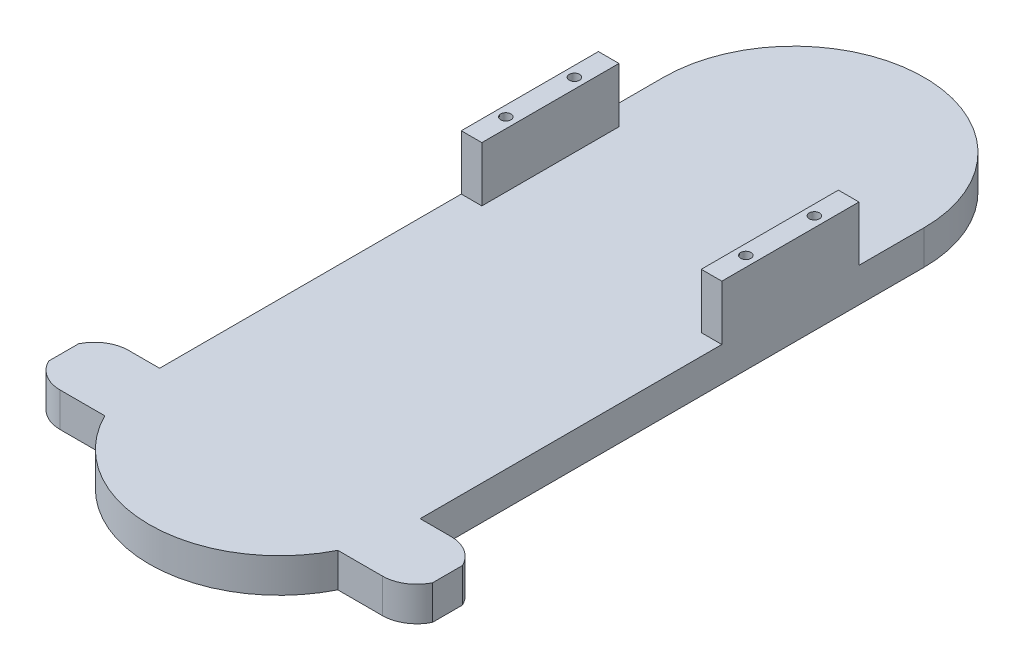
ISO-10303-21;
HEADER;
FILE_DESCRIPTION(('STEP AP214'),'2;1');
FILE_NAME('part.step','',(''),(''),'','','');
FILE_SCHEMA(('AUTOMOTIVE_DESIGN { 1 0 10303 214 1 1 1 1 }'));
ENDSEC;
DATA;
#1=APPLICATION_CONTEXT('core data for automotive mechanical design processes');
#2=APPLICATION_PROTOCOL_DEFINITION('international standard','automotive_design',2000,#1);
#3=PRODUCT_CONTEXT('',#1,'mechanical');
#4=PRODUCT('Part','Part','',(#3));
#5=PRODUCT_RELATED_PRODUCT_CATEGORY('part','',(#4));
#6=PRODUCT_DEFINITION_FORMATION('','',#4);
#7=PRODUCT_DEFINITION_CONTEXT('part definition',#1,'design');
#8=PRODUCT_DEFINITION('design','',#6,#7);
#9=PRODUCT_DEFINITION_SHAPE('','',#8);
#10=(LENGTH_UNIT() NAMED_UNIT(*) SI_UNIT(.MILLI.,.METRE.));
#11=(NAMED_UNIT(*) PLANE_ANGLE_UNIT() SI_UNIT($,.RADIAN.));
#12=(NAMED_UNIT(*) SI_UNIT($,.STERADIAN.) SOLID_ANGLE_UNIT());
#13=UNCERTAINTY_MEASURE_WITH_UNIT(LENGTH_MEASURE(1.E-05),#10,'distance_accuracy_value','');
#14=(GEOMETRIC_REPRESENTATION_CONTEXT(3) GLOBAL_UNCERTAINTY_ASSIGNED_CONTEXT((#13)) GLOBAL_UNIT_ASSIGNED_CONTEXT((#10,
#11,#12)) REPRESENTATION_CONTEXT('',''));
#15=CARTESIAN_POINT('',(0.,0.,0.));
#16=DIRECTION('',(0.,0.,1.));
#17=DIRECTION('',(1.,0.,0.));
#18=AXIS2_PLACEMENT_3D('',#15,#16,#17);
#19=CARTESIAN_POINT('',(0.,10.,75.));
#20=DIRECTION('',(0.,1.,0.));
#21=DIRECTION('',(0.,0.,1.));
#22=AXIS2_PLACEMENT_3D('',#19,#20,#21);
#23=PLANE('',#22);
#24=DIRECTION('',(0.,0.,1.));
#25=VECTOR('',#24,1.);
#26=CARTESIAN_POINT('',(-38.,10.,75.));
#27=LINE('',#26,#25);
#28=CARTESIAN_POINT('',(-38.,10.,-16.));
#29=VERTEX_POINT('',#28);
#30=CARTESIAN_POINT('',(-38.,10.,71.9999999999999));
#31=VERTEX_POINT('',#30);
#32=EDGE_CURVE('E365',#29,#31,#27,.T.);
#33=ORIENTED_EDGE('',*,*,#32,.T.);
#34=DIRECTION('',(-1.,0.,0.));
#35=VECTOR('',#34,1.);
#36=CARTESIAN_POINT('',(-47.,10.,71.9999999999999));
#37=LINE('',#36,#35);
#38=CARTESIAN_POINT('',(-47.,10.,71.9999999999999));
#39=VERTEX_POINT('',#38);
#40=EDGE_CURVE('E235',#31,#39,#37,.T.);
#41=ORIENTED_EDGE('',*,*,#40,.T.);
#42=CARTESIAN_POINT('',(-47.,10.,82.));
#43=DIRECTION('',(0.,1.,0.));
#44=DIRECTION('',(0.,0.,1.));
#45=AXIS2_PLACEMENT_3D('',#42,#43,#44);
#46=CIRCLE('',#45,10.);
#47=CARTESIAN_POINT('',(-56.,10.,77.6411010564592));
#48=VERTEX_POINT('',#47);
#49=EDGE_CURVE('E237',#39,#48,#46,.T.);
#50=ORIENTED_EDGE('',*,*,#49,.T.);
#51=DIRECTION('',(0.,0.,1.));
#52=VECTOR('',#51,1.);
#53=CARTESIAN_POINT('',(-56.,10.,77.6411010564592));
#54=LINE('',#53,#52);
#55=CARTESIAN_POINT('',(-56.,10.,86.3588989435407));
#56=VERTEX_POINT('',#55);
#57=EDGE_CURVE('E240',#48,#56,#54,.T.);
#58=ORIENTED_EDGE('',*,*,#57,.T.);
#59=CARTESIAN_POINT('',(-47.,10.,82.));
#60=DIRECTION('',(0.,1.,0.));
#61=DIRECTION('',(0.,0.,1.));
#62=AXIS2_PLACEMENT_3D('',#59,#60,#61);
#63=CIRCLE('',#62,10.);
#64=CARTESIAN_POINT('',(-47.,10.,92.));
#65=VERTEX_POINT('',#64);
#66=EDGE_CURVE('E243',#56,#65,#63,.T.);
#67=ORIENTED_EDGE('',*,*,#66,.T.);
#68=DIRECTION('',(1.,0.,0.));
#69=VECTOR('',#68,1.);
#70=CARTESIAN_POINT('',(-47.,10.,92.));
#71=LINE('',#70,#69);
#72=CARTESIAN_POINT('',(-33.9852909359328,10.,92.));
#73=VERTEX_POINT('',#72);
#74=EDGE_CURVE('E247',#65,#73,#71,.T.);
#75=ORIENTED_EDGE('',*,*,#74,.T.);
#76=CARTESIAN_POINT('',(0.,10.,75.));
#77=DIRECTION('',(0.,1.,0.));
#78=DIRECTION('',(0.,0.,1.));
#79=AXIS2_PLACEMENT_3D('',#76,#77,#78);
#80=CIRCLE('',#79,38.);
#81=CARTESIAN_POINT('',(33.9852909359329,10.,92.));
#82=VERTEX_POINT('',#81);
#83=EDGE_CURVE('E356',#73,#82,#80,.T.);
#84=ORIENTED_EDGE('',*,*,#83,.T.);
#85=CARTESIAN_POINT('',(47.,10.,92.));
#86=VERTEX_POINT('',#85);
#87=EDGE_CURVE('E246',#82,#86,#71,.T.);
#88=ORIENTED_EDGE('',*,*,#87,.T.);
#89=CARTESIAN_POINT('',(47.,10.,82.));
#90=DIRECTION('',(0.,1.,0.));
#91=DIRECTION('',(0.,0.,1.));
#92=AXIS2_PLACEMENT_3D('',#89,#90,#91);
#93=CIRCLE('',#92,9.99999999999998);
#94=CARTESIAN_POINT('',(56.,10.,86.3588989435407));
#95=VERTEX_POINT('',#94);
#96=EDGE_CURVE('E215',#86,#95,#93,.T.);
#97=ORIENTED_EDGE('',*,*,#96,.T.);
#98=DIRECTION('',(0.,0.,-1.));
#99=VECTOR('',#98,1.);
#100=CARTESIAN_POINT('',(56.,10.,77.6411010564594));
#101=LINE('',#100,#99);
#102=CARTESIAN_POINT('',(56.,10.,77.6411010564594));
#103=VERTEX_POINT('',#102);
#104=EDGE_CURVE('E212',#95,#103,#101,.T.);
#105=ORIENTED_EDGE('',*,*,#104,.T.);
#106=CARTESIAN_POINT('',(47.,10.,82.));
#107=DIRECTION('',(0.,1.,0.));
#108=DIRECTION('',(0.,0.,1.));
#109=AXIS2_PLACEMENT_3D('',#106,#107,#108);
#110=CIRCLE('',#109,9.99999999999999);
#111=CARTESIAN_POINT('',(47.,10.,72.));
#112=VERTEX_POINT('',#111);
#113=EDGE_CURVE('E233',#103,#112,#110,.T.);
#114=ORIENTED_EDGE('',*,*,#113,.T.);
#115=CARTESIAN_POINT('',(38.,10.,71.9999999999999));
#116=VERTEX_POINT('',#115);
#117=EDGE_CURVE('E51',#112,#116,#37,.T.);
#118=ORIENTED_EDGE('',*,*,#117,.T.);
#119=DIRECTION('',(0.,0.,-1.));
#120=VECTOR('',#119,1.);
#121=CARTESIAN_POINT('',(38.,10.,75.));
#122=LINE('',#121,#120);
#123=CARTESIAN_POINT('',(38.,10.,-16.));
#124=VERTEX_POINT('',#123);
#125=EDGE_CURVE('E361',#116,#124,#122,.T.);
#126=ORIENTED_EDGE('',*,*,#125,.T.);
#127=DIRECTION('',(1.,0.,0.));
#128=VECTOR('',#127,1.);
#129=CARTESIAN_POINT('',(38.,10.,-16.));
#130=LINE('',#129,#128);
#131=CARTESIAN_POINT('',(32.,10.,-16.));
#132=VERTEX_POINT('',#131);
#133=EDGE_CURVE('E306',#132,#124,#130,.T.);
#134=ORIENTED_EDGE('',*,*,#133,.F.);
#135=DIRECTION('',(0.,0.,1.));
#136=VECTOR('',#135,1.);
#137=CARTESIAN_POINT('',(32.,10.,-16.));
#138=LINE('',#137,#136);
#139=CARTESIAN_POINT('',(32.,10.,-56.));
#140=VERTEX_POINT('',#139);
#141=EDGE_CURVE('E314',#140,#132,#138,.T.);
#142=ORIENTED_EDGE('',*,*,#141,.F.);
#143=DIRECTION('',(-1.,0.,0.));
#144=VECTOR('',#143,1.);
#145=CARTESIAN_POINT('',(38.,10.,-56.));
#146=LINE('',#145,#144);
#147=CARTESIAN_POINT('',(38.,10.,-56.));
#148=VERTEX_POINT('',#147);
#149=EDGE_CURVE('E299',#148,#140,#146,.T.);
#150=ORIENTED_EDGE('',*,*,#149,.F.);
#151=CARTESIAN_POINT('',(37.9999999999999,10.,-75.));
#152=VERTEX_POINT('',#151);
#153=EDGE_CURVE('E359',#148,#152,#122,.T.);
#154=ORIENTED_EDGE('',*,*,#153,.T.);
#155=CARTESIAN_POINT('',(0.,10.,-75.));
#156=DIRECTION('',(0.,1.,0.));
#157=DIRECTION('',(0.,0.,1.));
#158=AXIS2_PLACEMENT_3D('',#155,#156,#157);
#159=CIRCLE('',#158,38.);
#160=CARTESIAN_POINT('',(-38.,10.,-75.));
#161=VERTEX_POINT('',#160);
#162=EDGE_CURVE('E363',#152,#161,#159,.T.);
#163=ORIENTED_EDGE('',*,*,#162,.T.);
#164=CARTESIAN_POINT('',(-38.,10.,-56.));
#165=VERTEX_POINT('',#164);
#166=EDGE_CURVE('E366',#161,#165,#27,.T.);
#167=ORIENTED_EDGE('',*,*,#166,.T.);
#168=DIRECTION('',(-1.,0.,0.));
#169=VECTOR('',#168,1.);
#170=CARTESIAN_POINT('',(-38.,10.,-56.));
#171=LINE('',#170,#169);
#172=CARTESIAN_POINT('',(-32.,10.,-56.));
#173=VERTEX_POINT('',#172);
#174=EDGE_CURVE('E330',#173,#165,#171,.T.);
#175=ORIENTED_EDGE('',*,*,#174,.F.);
#176=DIRECTION('',(0.,0.,-1.));
#177=VECTOR('',#176,1.);
#178=CARTESIAN_POINT('',(-32.,10.,-16.));
#179=LINE('',#178,#177);
#180=CARTESIAN_POINT('',(-32.,10.,-16.));
#181=VERTEX_POINT('',#180);
#182=EDGE_CURVE('E339',#181,#173,#179,.T.);
#183=ORIENTED_EDGE('',*,*,#182,.F.);
#184=DIRECTION('',(1.,0.,0.));
#185=VECTOR('',#184,1.);
#186=CARTESIAN_POINT('',(-38.,10.,-16.));
#187=LINE('',#186,#185);
#188=EDGE_CURVE('E325',#29,#181,#187,.T.);
#189=ORIENTED_EDGE('',*,*,#188,.F.);
#190=EDGE_LOOP('',(#33,#41,#50,#58,#67,#75,#84,#88,#97,#105,#114,#118,#126,#134,#142,#150,#154,
#163,#167,#175,#183,#189));
#191=FACE_BOUND('',#190,.T.);
#192=ADVANCED_FACE('F36',(#191),#23,.T.);
#193=CARTESIAN_POINT('',(0.,10.,75.));
#194=DIRECTION('',(0.,-1.,0.));
#195=DIRECTION('',(0.,0.,-1.));
#196=AXIS2_PLACEMENT_3D('',#193,#194,#195);
#197=CYLINDRICAL_SURFACE('',#196,38.);
#198=ORIENTED_EDGE('',*,*,#83,.F.);
#199=DIRECTION('',(0.,-1.,0.));
#200=VECTOR('',#199,1.);
#201=CARTESIAN_POINT('',(-33.9852909359328,10.,92.));
#202=LINE('',#201,#200);
#203=CARTESIAN_POINT('',(-33.9852909359328,0.,92.));
#204=VERTEX_POINT('',#203);
#205=EDGE_CURVE('E274',#73,#204,#202,.T.);
#206=ORIENTED_EDGE('',*,*,#205,.T.);
#207=CARTESIAN_POINT('',(0.,0.,75.));
#208=DIRECTION('',(0.,1.,0.));
#209=DIRECTION('',(0.,0.,1.));
#210=AXIS2_PLACEMENT_3D('',#207,#208,#209);
#211=CIRCLE('',#210,38.);
#212=CARTESIAN_POINT('',(33.9852909359329,0.,92.));
#213=VERTEX_POINT('',#212);
#214=EDGE_CURVE('E355',#204,#213,#211,.T.);
#215=ORIENTED_EDGE('',*,*,#214,.T.);
#216=DIRECTION('',(0.,-1.,0.));
#217=VECTOR('',#216,1.);
#218=CARTESIAN_POINT('',(33.9852909359329,10.,92.));
#219=LINE('',#218,#217);
#220=EDGE_CURVE('E271',#213,#82,#219,.F.);
#221=ORIENTED_EDGE('',*,*,#220,.T.);
#222=EDGE_LOOP('',(#198,#206,#215,#221));
#223=FACE_BOUND('',#222,.T.);
#224=ADVANCED_FACE('F38',(#223),#197,.T.);
#225=CARTESIAN_POINT('',(38.,10.,75.));
#226=DIRECTION('',(-1.,0.,0.));
#227=DIRECTION('',(0.,0.,1.));
#228=AXIS2_PLACEMENT_3D('',#225,#226,#227);
#229=PLANE('',#228);
#230=ORIENTED_EDGE('',*,*,#125,.F.);
#231=DIRECTION('',(0.,-1.,0.));
#232=VECTOR('',#231,1.);
#233=CARTESIAN_POINT('',(38.,10.,72.));
#234=LINE('',#233,#232);
#235=CARTESIAN_POINT('',(38.,0.,72.));
#236=VERTEX_POINT('',#235);
#237=EDGE_CURVE('E269',#116,#236,#234,.T.);
#238=ORIENTED_EDGE('',*,*,#237,.T.);
#239=DIRECTION('',(0.,0.,-1.));
#240=VECTOR('',#239,1.);
#241=CARTESIAN_POINT('',(38.,0.,75.));
#242=LINE('',#241,#240);
#243=CARTESIAN_POINT('',(37.9999999999999,0.,-75.));
#244=VERTEX_POINT('',#243);
#245=EDGE_CURVE('E206',#236,#244,#242,.T.);
#246=ORIENTED_EDGE('',*,*,#245,.T.);
#247=DIRECTION('',(0.,-1.,0.));
#248=VECTOR('',#247,1.);
#249=CARTESIAN_POINT('',(37.9999999999999,10.,-75.));
#250=LINE('',#249,#248);
#251=EDGE_CURVE('E11',#152,#244,#250,.T.);
#252=ORIENTED_EDGE('',*,*,#251,.F.);
#253=ORIENTED_EDGE('',*,*,#153,.F.);
#254=DIRECTION('',(0.,-1.,0.));
#255=VECTOR('',#254,1.);
#256=CARTESIAN_POINT('',(38.,26.,-56.));
#257=LINE('',#256,#255);
#258=CARTESIAN_POINT('',(38.,26.,-56.));
#259=VERTEX_POINT('',#258);
#260=EDGE_CURVE('E323',#259,#148,#257,.T.);
#261=ORIENTED_EDGE('',*,*,#260,.F.);
#262=DIRECTION('',(0.,0.,-1.));
#263=VECTOR('',#262,1.);
#264=CARTESIAN_POINT('',(38.,26.,-16.));
#265=LINE('',#264,#263);
#266=CARTESIAN_POINT('',(38.,26.,-16.));
#267=VERTEX_POINT('',#266);
#268=EDGE_CURVE('E302',#267,#259,#265,.T.);
#269=ORIENTED_EDGE('',*,*,#268,.F.);
#270=DIRECTION('',(0.,-1.,0.));
#271=VECTOR('',#270,1.);
#272=CARTESIAN_POINT('',(38.,26.,-16.));
#273=LINE('',#272,#271);
#274=EDGE_CURVE('E312',#267,#124,#273,.T.);
#275=ORIENTED_EDGE('',*,*,#274,.T.);
#276=EDGE_LOOP('',(#230,#238,#246,#252,#253,#261,#269,#275));
#277=FACE_BOUND('',#276,.T.);
#278=ADVANCED_FACE('F422',(#277),#229,.F.);
#279=CARTESIAN_POINT('',(0.,10.,-75.));
#280=DIRECTION('',(0.,-1.,0.));
#281=DIRECTION('',(0.,0.,-1.));
#282=AXIS2_PLACEMENT_3D('',#279,#280,#281);
#283=CYLINDRICAL_SURFACE('',#282,38.);
#284=CARTESIAN_POINT('',(0.,0.,-75.));
#285=DIRECTION('',(0.,1.,0.));
#286=DIRECTION('',(0.,0.,1.));
#287=AXIS2_PLACEMENT_3D('',#284,#285,#286);
#288=CIRCLE('',#287,38.);
#289=CARTESIAN_POINT('',(-38.,0.,-75.));
#290=VERTEX_POINT('',#289);
#291=EDGE_CURVE('E371',#244,#290,#288,.T.);
#292=ORIENTED_EDGE('',*,*,#291,.T.);
#293=DIRECTION('',(0.,-1.,0.));
#294=VECTOR('',#293,1.);
#295=CARTESIAN_POINT('',(-38.,10.,-75.));
#296=LINE('',#295,#294);
#297=EDGE_CURVE('E44',#161,#290,#296,.T.);
#298=ORIENTED_EDGE('',*,*,#297,.F.);
#299=ORIENTED_EDGE('',*,*,#162,.F.);
#300=ORIENTED_EDGE('',*,*,#251,.T.);
#301=EDGE_LOOP('',(#292,#298,#299,#300));
#302=FACE_BOUND('',#301,.T.);
#303=ADVANCED_FACE('F429',(#302),#283,.T.);
#304=CARTESIAN_POINT('',(-38.,10.,75.));
#305=DIRECTION('',(1.,0.,0.));
#306=DIRECTION('',(0.,0.,-1.));
#307=AXIS2_PLACEMENT_3D('',#304,#305,#306);
#308=PLANE('',#307);
#309=DIRECTION('',(0.,0.,1.));
#310=VECTOR('',#309,1.);
#311=CARTESIAN_POINT('',(-38.,0.,75.));
#312=LINE('',#311,#310);
#313=CARTESIAN_POINT('',(-38.0000000000001,0.,71.9999999999999));
#314=VERTEX_POINT('',#313);
#315=EDGE_CURVE('E360',#290,#314,#312,.T.);
#316=ORIENTED_EDGE('',*,*,#315,.T.);
#317=DIRECTION('',(0.,1.,0.));
#318=VECTOR('',#317,1.);
#319=CARTESIAN_POINT('',(-38.,10.,71.9999999999999));
#320=LINE('',#319,#318);
#321=EDGE_CURVE('E253',#314,#31,#320,.T.);
#322=ORIENTED_EDGE('',*,*,#321,.T.);
#323=ORIENTED_EDGE('',*,*,#32,.F.);
#324=DIRECTION('',(0.,-1.,0.));
#325=VECTOR('',#324,1.);
#326=CARTESIAN_POINT('',(-38.,26.,-16.));
#327=LINE('',#326,#325);
#328=CARTESIAN_POINT('',(-38.,26.,-16.));
#329=VERTEX_POINT('',#328);
#330=EDGE_CURVE('E352',#329,#29,#327,.T.);
#331=ORIENTED_EDGE('',*,*,#330,.F.);
#332=DIRECTION('',(0.,0.,1.));
#333=VECTOR('',#332,1.);
#334=CARTESIAN_POINT('',(-38.,26.,-16.));
#335=LINE('',#334,#333);
#336=CARTESIAN_POINT('',(-38.,26.,-56.));
#337=VERTEX_POINT('',#336);
#338=EDGE_CURVE('E326',#337,#329,#335,.T.);
#339=ORIENTED_EDGE('',*,*,#338,.F.);
#340=DIRECTION('',(0.,-1.,0.));
#341=VECTOR('',#340,1.);
#342=CARTESIAN_POINT('',(-38.,26.,-56.));
#343=LINE('',#342,#341);
#344=EDGE_CURVE('E336',#337,#165,#343,.T.);
#345=ORIENTED_EDGE('',*,*,#344,.T.);
#346=ORIENTED_EDGE('',*,*,#166,.F.);
#347=ORIENTED_EDGE('',*,*,#297,.T.);
#348=EDGE_LOOP('',(#316,#322,#323,#331,#339,#345,#346,#347));
#349=FACE_BOUND('',#348,.T.);
#350=ADVANCED_FACE('F379',(#349),#308,.F.);
#351=CARTESIAN_POINT('',(0.,0.,75.));
#352=DIRECTION('',(0.,1.,0.));
#353=DIRECTION('',(0.,0.,1.));
#354=AXIS2_PLACEMENT_3D('',#351,#352,#353);
#355=PLANE('',#354);
#356=ORIENTED_EDGE('',*,*,#214,.F.);
#357=DIRECTION('',(1.,0.,0.));
#358=VECTOR('',#357,1.);
#359=CARTESIAN_POINT('',(-47.,0.,92.));
#360=LINE('',#359,#358);
#361=CARTESIAN_POINT('',(-47.,0.,92.));
#362=VERTEX_POINT('',#361);
#363=EDGE_CURVE('E227',#362,#204,#360,.T.);
#364=ORIENTED_EDGE('',*,*,#363,.F.);
#365=CARTESIAN_POINT('',(-47.,0.,82.));
#366=DIRECTION('',(0.,1.,0.));
#367=DIRECTION('',(0.,0.,1.));
#368=AXIS2_PLACEMENT_3D('',#365,#366,#367);
#369=CIRCLE('',#368,10.);
#370=CARTESIAN_POINT('',(-56.,0.,86.3588989435407));
#371=VERTEX_POINT('',#370);
#372=EDGE_CURVE('E223',#371,#362,#369,.T.);
#373=ORIENTED_EDGE('',*,*,#372,.F.);
#374=DIRECTION('',(0.,0.,1.));
#375=VECTOR('',#374,1.);
#376=CARTESIAN_POINT('',(-56.,0.,77.6411010564592));
#377=LINE('',#376,#375);
#378=CARTESIAN_POINT('',(-56.,0.,77.6411010564592));
#379=VERTEX_POINT('',#378);
#380=EDGE_CURVE('E220',#379,#371,#377,.T.);
#381=ORIENTED_EDGE('',*,*,#380,.F.);
#382=CARTESIAN_POINT('',(-47.,0.,82.));
#383=DIRECTION('',(0.,1.,0.));
#384=DIRECTION('',(0.,0.,1.));
#385=AXIS2_PLACEMENT_3D('',#382,#383,#384);
#386=CIRCLE('',#385,10.);
#387=CARTESIAN_POINT('',(-47.,0.,71.9999999999999));
#388=VERTEX_POINT('',#387);
#389=EDGE_CURVE('E207',#388,#379,#386,.T.);
#390=ORIENTED_EDGE('',*,*,#389,.F.);
#391=DIRECTION('',(-1.,0.,0.));
#392=VECTOR('',#391,1.);
#393=CARTESIAN_POINT('',(-47.,0.,71.9999999999999));
#394=LINE('',#393,#392);
#395=EDGE_CURVE('E208',#314,#388,#394,.T.);
#396=ORIENTED_EDGE('',*,*,#395,.F.);
#397=ORIENTED_EDGE('',*,*,#315,.F.);
#398=ORIENTED_EDGE('',*,*,#291,.F.);
#399=ORIENTED_EDGE('',*,*,#245,.F.);
#400=CARTESIAN_POINT('',(47.,0.,72.));
#401=VERTEX_POINT('',#400);
#402=EDGE_CURVE('E189',#401,#236,#394,.T.);
#403=ORIENTED_EDGE('',*,*,#402,.F.);
#404=CARTESIAN_POINT('',(47.,0.,82.));
#405=DIRECTION('',(0.,1.,0.));
#406=DIRECTION('',(0.,0.,1.));
#407=AXIS2_PLACEMENT_3D('',#404,#405,#406);
#408=CIRCLE('',#407,9.99999999999999);
#409=CARTESIAN_POINT('',(56.,0.,77.6411010564594));
#410=VERTEX_POINT('',#409);
#411=EDGE_CURVE('E203',#410,#401,#408,.T.);
#412=ORIENTED_EDGE('',*,*,#411,.F.);
#413=DIRECTION('',(0.,0.,-1.));
#414=VECTOR('',#413,1.);
#415=CARTESIAN_POINT('',(56.,0.,77.6411010564594));
#416=LINE('',#415,#414);
#417=CARTESIAN_POINT('',(56.,0.,86.3588989435407));
#418=VERTEX_POINT('',#417);
#419=EDGE_CURVE('E195',#418,#410,#416,.T.);
#420=ORIENTED_EDGE('',*,*,#419,.F.);
#421=CARTESIAN_POINT('',(47.,0.,82.));
#422=DIRECTION('',(0.,1.,0.));
#423=DIRECTION('',(0.,0.,1.));
#424=AXIS2_PLACEMENT_3D('',#421,#422,#423);
#425=CIRCLE('',#424,9.99999999999998);
#426=CARTESIAN_POINT('',(47.,0.,92.));
#427=VERTEX_POINT('',#426);
#428=EDGE_CURVE('E229',#427,#418,#425,.T.);
#429=ORIENTED_EDGE('',*,*,#428,.F.);
#430=EDGE_CURVE('E226',#213,#427,#360,.T.);
#431=ORIENTED_EDGE('',*,*,#430,.F.);
#432=EDGE_LOOP('',(#356,#364,#373,#381,#390,#396,#397,#398,#399,#403,#412,#420,#429,#431));
#433=FACE_BOUND('',#432,.T.);
#434=ADVANCED_FACE('F201',(#433),#355,.F.);
#435=CARTESIAN_POINT('',(-38.,26.,-16.));
#436=DIRECTION('',(0.,0.,-1.));
#437=DIRECTION('',(-1.,0.,0.));
#438=AXIS2_PLACEMENT_3D('',#435,#436,#437);
#439=PLANE('',#438);
#440=ORIENTED_EDGE('',*,*,#188,.T.);
#441=DIRECTION('',(0.,-1.,0.));
#442=VECTOR('',#441,1.);
#443=CARTESIAN_POINT('',(-32.,26.,-16.));
#444=LINE('',#443,#442);
#445=CARTESIAN_POINT('',(-32.,26.,-16.));
#446=VERTEX_POINT('',#445);
#447=EDGE_CURVE('E349',#446,#181,#444,.T.);
#448=ORIENTED_EDGE('',*,*,#447,.F.);
#449=DIRECTION('',(1.,0.,0.));
#450=VECTOR('',#449,1.);
#451=CARTESIAN_POINT('',(-38.,26.,-16.));
#452=LINE('',#451,#450);
#453=EDGE_CURVE('E329',#329,#446,#452,.T.);
#454=ORIENTED_EDGE('',*,*,#453,.F.);
#455=ORIENTED_EDGE('',*,*,#330,.T.);
#456=EDGE_LOOP('',(#440,#448,#454,#455));
#457=FACE_BOUND('',#456,.T.);
#458=ADVANCED_FACE('F397',(#457),#439,.F.);
#459=CARTESIAN_POINT('',(-32.,26.,-16.));
#460=DIRECTION('',(-1.,0.,0.));
#461=DIRECTION('',(0.,0.,1.));
#462=AXIS2_PLACEMENT_3D('',#459,#460,#461);
#463=PLANE('',#462);
#464=ORIENTED_EDGE('',*,*,#182,.T.);
#465=DIRECTION('',(0.,-1.,0.));
#466=VECTOR('',#465,1.);
#467=CARTESIAN_POINT('',(-32.,26.,-56.));
#468=LINE('',#467,#466);
#469=CARTESIAN_POINT('',(-32.,26.,-56.));
#470=VERTEX_POINT('',#469);
#471=EDGE_CURVE('E346',#470,#173,#468,.T.);
#472=ORIENTED_EDGE('',*,*,#471,.F.);
#473=DIRECTION('',(0.,0.,-1.));
#474=VECTOR('',#473,1.);
#475=CARTESIAN_POINT('',(-32.,26.,-16.));
#476=LINE('',#475,#474);
#477=EDGE_CURVE('E332',#446,#470,#476,.T.);
#478=ORIENTED_EDGE('',*,*,#477,.F.);
#479=ORIENTED_EDGE('',*,*,#447,.T.);
#480=EDGE_LOOP('',(#464,#472,#478,#479));
#481=FACE_BOUND('',#480,.T.);
#482=ADVANCED_FACE('F408',(#481),#463,.F.);
#483=CARTESIAN_POINT('',(-38.,26.,-56.));
#484=DIRECTION('',(0.,0.,1.));
#485=DIRECTION('',(1.,0.,0.));
#486=AXIS2_PLACEMENT_3D('',#483,#484,#485);
#487=PLANE('',#486);
#488=ORIENTED_EDGE('',*,*,#174,.T.);
#489=ORIENTED_EDGE('',*,*,#344,.F.);
#490=DIRECTION('',(-1.,0.,0.));
#491=VECTOR('',#490,1.);
#492=CARTESIAN_POINT('',(-38.,26.,-56.));
#493=LINE('',#492,#491);
#494=EDGE_CURVE('E334',#470,#337,#493,.T.);
#495=ORIENTED_EDGE('',*,*,#494,.F.);
#496=ORIENTED_EDGE('',*,*,#471,.T.);
#497=EDGE_LOOP('',(#488,#489,#495,#496));
#498=FACE_BOUND('',#497,.T.);
#499=ADVANCED_FACE('F405',(#498),#487,.F.);
#500=CARTESIAN_POINT('',(0.,26.,0.));
#501=DIRECTION('',(0.,-1.,0.));
#502=DIRECTION('',(0.,0.,-1.));
#503=AXIS2_PLACEMENT_3D('',#500,#501,#502);
#504=PLANE('',#503);
#505=CARTESIAN_POINT('',(-35.,26.,-46.));
#506=DIRECTION('',(0.,1.,0.));
#507=DIRECTION('',(0.,0.,1.));
#508=AXIS2_PLACEMENT_3D('',#505,#506,#507);
#509=CIRCLE('',#508,1.5);
#510=CARTESIAN_POINT('',(-35.,26.,-44.5));
#511=VERTEX_POINT('',#510);
#512=EDGE_CURVE('E288',#511,#511,#509,.T.);
#513=ORIENTED_EDGE('',*,*,#512,.F.);
#514=EDGE_LOOP('',(#513));
#515=FACE_BOUND('',#514,.T.);
#516=CARTESIAN_POINT('',(-35.,26.,-26.));
#517=DIRECTION('',(0.,1.,0.));
#518=DIRECTION('',(0.,0.,1.));
#519=AXIS2_PLACEMENT_3D('',#516,#517,#518);
#520=CIRCLE('',#519,1.5);
#521=CARTESIAN_POINT('',(-35.,26.,-24.5));
#522=VERTEX_POINT('',#521);
#523=EDGE_CURVE('E287',#522,#522,#520,.T.);
#524=ORIENTED_EDGE('',*,*,#523,.F.);
#525=EDGE_LOOP('',(#524));
#526=FACE_BOUND('',#525,.T.);
#527=ORIENTED_EDGE('',*,*,#338,.T.);
#528=ORIENTED_EDGE('',*,*,#453,.T.);
#529=ORIENTED_EDGE('',*,*,#477,.T.);
#530=ORIENTED_EDGE('',*,*,#494,.T.);
#531=EDGE_LOOP('',(#527,#528,#529,#530));
#532=FACE_BOUND('',#531,.T.);
#533=ADVANCED_FACE('F401',(#515,#526,#532),#504,.F.);
#534=CARTESIAN_POINT('',(38.,26.,-56.));
#535=DIRECTION('',(0.,0.,1.));
#536=DIRECTION('',(1.,0.,0.));
#537=AXIS2_PLACEMENT_3D('',#534,#535,#536);
#538=PLANE('',#537);
#539=ORIENTED_EDGE('',*,*,#149,.T.);
#540=DIRECTION('',(0.,-1.,0.));
#541=VECTOR('',#540,1.);
#542=CARTESIAN_POINT('',(32.,26.,-56.));
#543=LINE('',#542,#541);
#544=CARTESIAN_POINT('',(32.,26.,-56.));
#545=VERTEX_POINT('',#544);
#546=EDGE_CURVE('E320',#545,#140,#543,.T.);
#547=ORIENTED_EDGE('',*,*,#546,.F.);
#548=DIRECTION('',(-1.,0.,0.));
#549=VECTOR('',#548,1.);
#550=CARTESIAN_POINT('',(38.,26.,-56.));
#551=LINE('',#550,#549);
#552=EDGE_CURVE('E305',#259,#545,#551,.T.);
#553=ORIENTED_EDGE('',*,*,#552,.F.);
#554=ORIENTED_EDGE('',*,*,#260,.T.);
#555=EDGE_LOOP('',(#539,#547,#553,#554));
#556=FACE_BOUND('',#555,.T.);
#557=ADVANCED_FACE('F452',(#556),#538,.F.);
#558=CARTESIAN_POINT('',(32.,26.,-16.));
#559=DIRECTION('',(1.,0.,0.));
#560=DIRECTION('',(0.,0.,-1.));
#561=AXIS2_PLACEMENT_3D('',#558,#559,#560);
#562=PLANE('',#561);
#563=ORIENTED_EDGE('',*,*,#141,.T.);
#564=DIRECTION('',(0.,-1.,0.));
#565=VECTOR('',#564,1.);
#566=CARTESIAN_POINT('',(32.,26.,-16.));
#567=LINE('',#566,#565);
#568=CARTESIAN_POINT('',(32.,26.,-16.));
#569=VERTEX_POINT('',#568);
#570=EDGE_CURVE('E59',#569,#132,#567,.T.);
#571=ORIENTED_EDGE('',*,*,#570,.F.);
#572=DIRECTION('',(0.,0.,1.));
#573=VECTOR('',#572,1.);
#574=CARTESIAN_POINT('',(32.,26.,-16.));
#575=LINE('',#574,#573);
#576=EDGE_CURVE('E308',#545,#569,#575,.T.);
#577=ORIENTED_EDGE('',*,*,#576,.F.);
#578=ORIENTED_EDGE('',*,*,#546,.T.);
#579=EDGE_LOOP('',(#563,#571,#577,#578));
#580=FACE_BOUND('',#579,.T.);
#581=ADVANCED_FACE('F448',(#580),#562,.F.);
#582=CARTESIAN_POINT('',(38.,26.,-16.));
#583=DIRECTION('',(0.,0.,-1.));
#584=DIRECTION('',(-1.,0.,0.));
#585=AXIS2_PLACEMENT_3D('',#582,#583,#584);
#586=PLANE('',#585);
#587=ORIENTED_EDGE('',*,*,#133,.T.);
#588=ORIENTED_EDGE('',*,*,#274,.F.);
#589=DIRECTION('',(1.,0.,0.));
#590=VECTOR('',#589,1.);
#591=CARTESIAN_POINT('',(38.,26.,-16.));
#592=LINE('',#591,#590);
#593=EDGE_CURVE('E310',#569,#267,#592,.T.);
#594=ORIENTED_EDGE('',*,*,#593,.F.);
#595=ORIENTED_EDGE('',*,*,#570,.T.);
#596=EDGE_LOOP('',(#587,#588,#594,#595));
#597=FACE_BOUND('',#596,.T.);
#598=ADVANCED_FACE('F440',(#597),#586,.F.);
#599=CARTESIAN_POINT('',(0.,26.,0.));
#600=DIRECTION('',(0.,1.,0.));
#601=DIRECTION('',(0.,0.,1.));
#602=AXIS2_PLACEMENT_3D('',#599,#600,#601);
#603=PLANE('',#602);
#604=CARTESIAN_POINT('',(35.,26.,-26.));
#605=DIRECTION('',(0.,1.,0.));
#606=DIRECTION('',(0.,0.,1.));
#607=AXIS2_PLACEMENT_3D('',#604,#605,#606);
#608=CIRCLE('',#607,1.5);
#609=CARTESIAN_POINT('',(35.,26.,-24.5));
#610=VERTEX_POINT('',#609);
#611=EDGE_CURVE('E281',#610,#610,#608,.T.);
#612=ORIENTED_EDGE('',*,*,#611,.F.);
#613=EDGE_LOOP('',(#612));
#614=FACE_BOUND('',#613,.T.);
#615=CARTESIAN_POINT('',(35.,26.,-46.));
#616=DIRECTION('',(0.,1.,0.));
#617=DIRECTION('',(0.,0.,1.));
#618=AXIS2_PLACEMENT_3D('',#615,#616,#617);
#619=CIRCLE('',#618,1.5);
#620=CARTESIAN_POINT('',(35.,26.,-44.5));
#621=VERTEX_POINT('',#620);
#622=EDGE_CURVE('E277',#621,#621,#619,.T.);
#623=ORIENTED_EDGE('',*,*,#622,.F.);
#624=EDGE_LOOP('',(#623));
#625=FACE_BOUND('',#624,.T.);
#626=ORIENTED_EDGE('',*,*,#268,.T.);
#627=ORIENTED_EDGE('',*,*,#552,.T.);
#628=ORIENTED_EDGE('',*,*,#576,.T.);
#629=ORIENTED_EDGE('',*,*,#593,.T.);
#630=EDGE_LOOP('',(#626,#627,#628,#629));
#631=FACE_BOUND('',#630,.T.);
#632=ADVANCED_FACE('F444',(#614,#625,#631),#603,.T.);
#633=CARTESIAN_POINT('',(35.,16.,-46.));
#634=DIRECTION('',(0.,1.,0.));
#635=DIRECTION('',(0.,0.,1.));
#636=AXIS2_PLACEMENT_3D('',#633,#634,#635);
#637=CYLINDRICAL_SURFACE('',#636,1.5);
#638=CARTESIAN_POINT('',(35.,16.,-46.));
#639=DIRECTION('',(0.,1.,0.));
#640=DIRECTION('',(0.,0.,1.));
#641=AXIS2_PLACEMENT_3D('',#638,#639,#640);
#642=CIRCLE('',#641,1.5);
#643=CARTESIAN_POINT('',(35.,16.,-44.5));
#644=VERTEX_POINT('',#643);
#645=EDGE_CURVE('E278',#644,#644,#642,.T.);
#646=ORIENTED_EDGE('',*,*,#645,.F.);
#647=EDGE_LOOP('',(#646));
#648=FACE_BOUND('',#647,.T.);
#649=ORIENTED_EDGE('',*,*,#622,.T.);
#650=EDGE_LOOP('',(#649));
#651=FACE_BOUND('',#650,.T.);
#652=ADVANCED_FACE('F467',(#648,#651),#637,.F.);
#653=CARTESIAN_POINT('',(35.,16.,-46.));
#654=DIRECTION('',(0.,1.,0.));
#655=DIRECTION('',(0.,0.,1.));
#656=AXIS2_PLACEMENT_3D('',#653,#654,#655);
#657=PLANE('',#656);
#658=ORIENTED_EDGE('',*,*,#645,.T.);
#659=EDGE_LOOP('',(#658));
#660=FACE_BOUND('',#659,.T.);
#661=ADVANCED_FACE('F482',(#660),#657,.T.);
#662=CARTESIAN_POINT('',(35.,16.,-26.));
#663=DIRECTION('',(0.,1.,0.));
#664=DIRECTION('',(0.,0.,1.));
#665=AXIS2_PLACEMENT_3D('',#662,#663,#664);
#666=CYLINDRICAL_SURFACE('',#665,1.5);
#667=CARTESIAN_POINT('',(35.,16.,-26.));
#668=DIRECTION('',(0.,1.,0.));
#669=DIRECTION('',(0.,0.,1.));
#670=AXIS2_PLACEMENT_3D('',#667,#668,#669);
#671=CIRCLE('',#670,1.5);
#672=CARTESIAN_POINT('',(35.,16.,-24.5));
#673=VERTEX_POINT('',#672);
#674=EDGE_CURVE('E291',#673,#673,#671,.T.);
#675=ORIENTED_EDGE('',*,*,#674,.F.);
#676=EDGE_LOOP('',(#675));
#677=FACE_BOUND('',#676,.T.);
#678=ORIENTED_EDGE('',*,*,#611,.T.);
#679=EDGE_LOOP('',(#678));
#680=FACE_BOUND('',#679,.T.);
#681=ADVANCED_FACE('F479',(#677,#680),#666,.F.);
#682=CARTESIAN_POINT('',(35.,16.,-26.));
#683=DIRECTION('',(0.,1.,0.));
#684=DIRECTION('',(0.,0.,1.));
#685=AXIS2_PLACEMENT_3D('',#682,#683,#684);
#686=PLANE('',#685);
#687=ORIENTED_EDGE('',*,*,#674,.T.);
#688=EDGE_LOOP('',(#687));
#689=FACE_BOUND('',#688,.T.);
#690=ADVANCED_FACE('F473',(#689),#686,.T.);
#691=CARTESIAN_POINT('',(-35.,16.,-26.));
#692=DIRECTION('',(0.,1.,0.));
#693=DIRECTION('',(0.,0.,1.));
#694=AXIS2_PLACEMENT_3D('',#691,#692,#693);
#695=CYLINDRICAL_SURFACE('',#694,1.5);
#696=CARTESIAN_POINT('',(-35.,16.,-26.));
#697=DIRECTION('',(0.,1.,0.));
#698=DIRECTION('',(0.,0.,1.));
#699=AXIS2_PLACEMENT_3D('',#696,#697,#698);
#700=CIRCLE('',#699,1.5);
#701=CARTESIAN_POINT('',(-35.,16.,-24.5));
#702=VERTEX_POINT('',#701);
#703=EDGE_CURVE('E296',#702,#702,#700,.T.);
#704=ORIENTED_EDGE('',*,*,#703,.F.);
#705=EDGE_LOOP('',(#704));
#706=FACE_BOUND('',#705,.T.);
#707=ORIENTED_EDGE('',*,*,#523,.T.);
#708=EDGE_LOOP('',(#707));
#709=FACE_BOUND('',#708,.T.);
#710=ADVANCED_FACE('F469',(#706,#709),#695,.F.);
#711=CARTESIAN_POINT('',(-35.,16.,-26.));
#712=DIRECTION('',(0.,1.,0.));
#713=DIRECTION('',(0.,0.,1.));
#714=AXIS2_PLACEMENT_3D('',#711,#712,#713);
#715=PLANE('',#714);
#716=ORIENTED_EDGE('',*,*,#703,.T.);
#717=EDGE_LOOP('',(#716));
#718=FACE_BOUND('',#717,.T.);
#719=ADVANCED_FACE('F472',(#718),#715,.T.);
#720=CARTESIAN_POINT('',(-35.,16.,-46.));
#721=DIRECTION('',(0.,1.,0.));
#722=DIRECTION('',(0.,0.,1.));
#723=AXIS2_PLACEMENT_3D('',#720,#721,#722);
#724=CYLINDRICAL_SURFACE('',#723,1.5);
#725=CARTESIAN_POINT('',(-35.,16.,-46.));
#726=DIRECTION('',(0.,1.,0.));
#727=DIRECTION('',(0.,0.,1.));
#728=AXIS2_PLACEMENT_3D('',#725,#726,#727);
#729=CIRCLE('',#728,1.5);
#730=CARTESIAN_POINT('',(-35.,16.,-44.5));
#731=VERTEX_POINT('',#730);
#732=EDGE_CURVE('E284',#731,#731,#729,.T.);
#733=ORIENTED_EDGE('',*,*,#732,.F.);
#734=EDGE_LOOP('',(#733));
#735=FACE_BOUND('',#734,.T.);
#736=ORIENTED_EDGE('',*,*,#512,.T.);
#737=EDGE_LOOP('',(#736));
#738=FACE_BOUND('',#737,.T.);
#739=ADVANCED_FACE('F477',(#735,#738),#724,.F.);
#740=CARTESIAN_POINT('',(-35.,16.,-46.));
#741=DIRECTION('',(0.,1.,0.));
#742=DIRECTION('',(0.,0.,1.));
#743=AXIS2_PLACEMENT_3D('',#740,#741,#742);
#744=PLANE('',#743);
#745=ORIENTED_EDGE('',*,*,#732,.T.);
#746=EDGE_LOOP('',(#745));
#747=FACE_BOUND('',#746,.T.);
#748=ADVANCED_FACE('F489',(#747),#744,.T.);
#749=CARTESIAN_POINT('',(-47.,0.,82.));
#750=DIRECTION('',(0.,1.,0.));
#751=DIRECTION('',(0.,0.,1.));
#752=AXIS2_PLACEMENT_3D('',#749,#750,#751);
#753=CYLINDRICAL_SURFACE('',#752,10.);
#754=ORIENTED_EDGE('',*,*,#66,.F.);
#755=DIRECTION('',(0.,1.,0.));
#756=VECTOR('',#755,1.);
#757=CARTESIAN_POINT('',(-56.,0.,86.3588989435407));
#758=LINE('',#757,#756);
#759=EDGE_CURVE('E261',#371,#56,#758,.T.);
#760=ORIENTED_EDGE('',*,*,#759,.F.);
#761=ORIENTED_EDGE('',*,*,#372,.T.);
#762=DIRECTION('',(0.,1.,0.));
#763=VECTOR('',#762,1.);
#764=CARTESIAN_POINT('',(-47.,0.,92.));
#765=LINE('',#764,#763);
#766=EDGE_CURVE('E259',#362,#65,#765,.T.);
#767=ORIENTED_EDGE('',*,*,#766,.T.);
#768=EDGE_LOOP('',(#754,#760,#761,#767));
#769=FACE_BOUND('',#768,.T.);
#770=ADVANCED_FACE('F493',(#769),#753,.T.);
#771=CARTESIAN_POINT('',(-56.,0.,77.6411010564592));
#772=DIRECTION('',(-1.,0.,0.));
#773=DIRECTION('',(0.,0.,1.));
#774=AXIS2_PLACEMENT_3D('',#771,#772,#773);
#775=PLANE('',#774);
#776=ORIENTED_EDGE('',*,*,#57,.F.);
#777=DIRECTION('',(0.,1.,0.));
#778=VECTOR('',#777,1.);
#779=CARTESIAN_POINT('',(-56.,0.,77.6411010564592));
#780=LINE('',#779,#778);
#781=EDGE_CURVE('E263',#379,#48,#780,.T.);
#782=ORIENTED_EDGE('',*,*,#781,.F.);
#783=ORIENTED_EDGE('',*,*,#380,.T.);
#784=ORIENTED_EDGE('',*,*,#759,.T.);
#785=EDGE_LOOP('',(#776,#782,#783,#784));
#786=FACE_BOUND('',#785,.T.);
#787=ADVANCED_FACE('F509',(#786),#775,.T.);
#788=CARTESIAN_POINT('',(-47.,0.,82.));
#789=DIRECTION('',(0.,1.,0.));
#790=DIRECTION('',(0.,0.,1.));
#791=AXIS2_PLACEMENT_3D('',#788,#789,#790);
#792=CYLINDRICAL_SURFACE('',#791,10.);
#793=ORIENTED_EDGE('',*,*,#49,.F.);
#794=DIRECTION('',(0.,1.,0.));
#795=VECTOR('',#794,1.);
#796=CARTESIAN_POINT('',(-47.,0.,71.9999999999999));
#797=LINE('',#796,#795);
#798=EDGE_CURVE('E194',#388,#39,#797,.T.);
#799=ORIENTED_EDGE('',*,*,#798,.F.);
#800=ORIENTED_EDGE('',*,*,#389,.T.);
#801=ORIENTED_EDGE('',*,*,#781,.T.);
#802=EDGE_LOOP('',(#793,#799,#800,#801));
#803=FACE_BOUND('',#802,.T.);
#804=ADVANCED_FACE('F390',(#803),#792,.T.);
#805=CARTESIAN_POINT('',(-47.,0.,71.9999999999999));
#806=DIRECTION('',(0.,0.,-1.));
#807=DIRECTION('',(-1.,0.,0.));
#808=AXIS2_PLACEMENT_3D('',#805,#806,#807);
#809=PLANE('',#808);
#810=ORIENTED_EDGE('',*,*,#321,.F.);
#811=ORIENTED_EDGE('',*,*,#395,.T.);
#812=ORIENTED_EDGE('',*,*,#798,.T.);
#813=ORIENTED_EDGE('',*,*,#40,.F.);
#814=EDGE_LOOP('',(#810,#811,#812,#813));
#815=FACE_BOUND('',#814,.T.);
#816=ADVANCED_FACE('F387',(#815),#809,.T.);
#817=CARTESIAN_POINT('',(-47.,0.,92.));
#818=DIRECTION('',(0.,0.,1.));
#819=DIRECTION('',(1.,0.,0.));
#820=AXIS2_PLACEMENT_3D('',#817,#818,#819);
#821=PLANE('',#820);
#822=ORIENTED_EDGE('',*,*,#205,.F.);
#823=ORIENTED_EDGE('',*,*,#74,.F.);
#824=ORIENTED_EDGE('',*,*,#766,.F.);
#825=ORIENTED_EDGE('',*,*,#363,.T.);
#826=EDGE_LOOP('',(#822,#823,#824,#825));
#827=FACE_BOUND('',#826,.T.);
#828=ADVANCED_FACE('F516',(#827),#821,.T.);
#829=ORIENTED_EDGE('',*,*,#220,.F.);
#830=ORIENTED_EDGE('',*,*,#430,.T.);
#831=DIRECTION('',(0.,1.,0.));
#832=VECTOR('',#831,1.);
#833=CARTESIAN_POINT('',(47.,0.,92.));
#834=LINE('',#833,#832);
#835=EDGE_CURVE('E256',#427,#86,#834,.T.);
#836=ORIENTED_EDGE('',*,*,#835,.T.);
#837=ORIENTED_EDGE('',*,*,#87,.F.);
#838=EDGE_LOOP('',(#829,#830,#836,#837));
#839=FACE_BOUND('',#838,.T.);
#840=ADVANCED_FACE('F506',(#839),#821,.T.);
#841=ORIENTED_EDGE('',*,*,#237,.F.);
#842=ORIENTED_EDGE('',*,*,#117,.F.);
#843=DIRECTION('',(0.,1.,0.));
#844=VECTOR('',#843,1.);
#845=CARTESIAN_POINT('',(47.,0.,72.));
#846=LINE('',#845,#844);
#847=EDGE_CURVE('E186',#401,#112,#846,.T.);
#848=ORIENTED_EDGE('',*,*,#847,.F.);
#849=ORIENTED_EDGE('',*,*,#402,.T.);
#850=EDGE_LOOP('',(#841,#842,#848,#849));
#851=FACE_BOUND('',#850,.T.);
#852=ADVANCED_FACE('F188',(#851),#809,.T.);
#853=CARTESIAN_POINT('',(47.,0.,82.));
#854=DIRECTION('',(0.,1.,0.));
#855=DIRECTION('',(0.,0.,1.));
#856=AXIS2_PLACEMENT_3D('',#853,#854,#855);
#857=CYLINDRICAL_SURFACE('',#856,9.99999999999999);
#858=ORIENTED_EDGE('',*,*,#113,.F.);
#859=DIRECTION('',(0.,1.,0.));
#860=VECTOR('',#859,1.);
#861=CARTESIAN_POINT('',(56.,0.,77.6411010564594));
#862=LINE('',#861,#860);
#863=EDGE_CURVE('E211',#410,#103,#862,.T.);
#864=ORIENTED_EDGE('',*,*,#863,.F.);
#865=ORIENTED_EDGE('',*,*,#411,.T.);
#866=ORIENTED_EDGE('',*,*,#847,.T.);
#867=EDGE_LOOP('',(#858,#864,#865,#866));
#868=FACE_BOUND('',#867,.T.);
#869=ADVANCED_FACE('F210',(#868),#857,.T.);
#870=CARTESIAN_POINT('',(56.,0.,77.6411010564594));
#871=DIRECTION('',(1.,0.,0.));
#872=DIRECTION('',(0.,0.,-1.));
#873=AXIS2_PLACEMENT_3D('',#870,#871,#872);
#874=PLANE('',#873);
#875=ORIENTED_EDGE('',*,*,#104,.F.);
#876=DIRECTION('',(0.,1.,0.));
#877=VECTOR('',#876,1.);
#878=CARTESIAN_POINT('',(56.,0.,86.3588989435407));
#879=LINE('',#878,#877);
#880=EDGE_CURVE('E254',#418,#95,#879,.T.);
#881=ORIENTED_EDGE('',*,*,#880,.F.);
#882=ORIENTED_EDGE('',*,*,#419,.T.);
#883=ORIENTED_EDGE('',*,*,#863,.T.);
#884=EDGE_LOOP('',(#875,#881,#882,#883));
#885=FACE_BOUND('',#884,.T.);
#886=ADVANCED_FACE('F503',(#885),#874,.T.);
#887=CARTESIAN_POINT('',(47.,0.,82.));
#888=DIRECTION('',(0.,1.,0.));
#889=DIRECTION('',(0.,0.,1.));
#890=AXIS2_PLACEMENT_3D('',#887,#888,#889);
#891=CYLINDRICAL_SURFACE('',#890,9.99999999999998);
#892=ORIENTED_EDGE('',*,*,#96,.F.);
#893=ORIENTED_EDGE('',*,*,#835,.F.);
#894=ORIENTED_EDGE('',*,*,#428,.T.);
#895=ORIENTED_EDGE('',*,*,#880,.T.);
#896=EDGE_LOOP('',(#892,#893,#894,#895));
#897=FACE_BOUND('',#896,.T.);
#898=ADVANCED_FACE('F520',(#897),#891,.T.);
#899=CLOSED_SHELL('',(#192,#224,#278,#303,#350,#434,#458,#482,#499,#533,#557,#581,#598,#632,
#652,#661,#681,#690,#710,#719,#739,#748,#770,#787,#804,#816,#828,#840,#852,#869,#886,#898));
#900=MANIFOLD_SOLID_BREP('B2',#899);
#901=ADVANCED_BREP_SHAPE_REPRESENTATION('',(#18,#900),#14);
#902=SHAPE_DEFINITION_REPRESENTATION(#9,#901);
ENDSEC;
END-ISO-10303-21;
